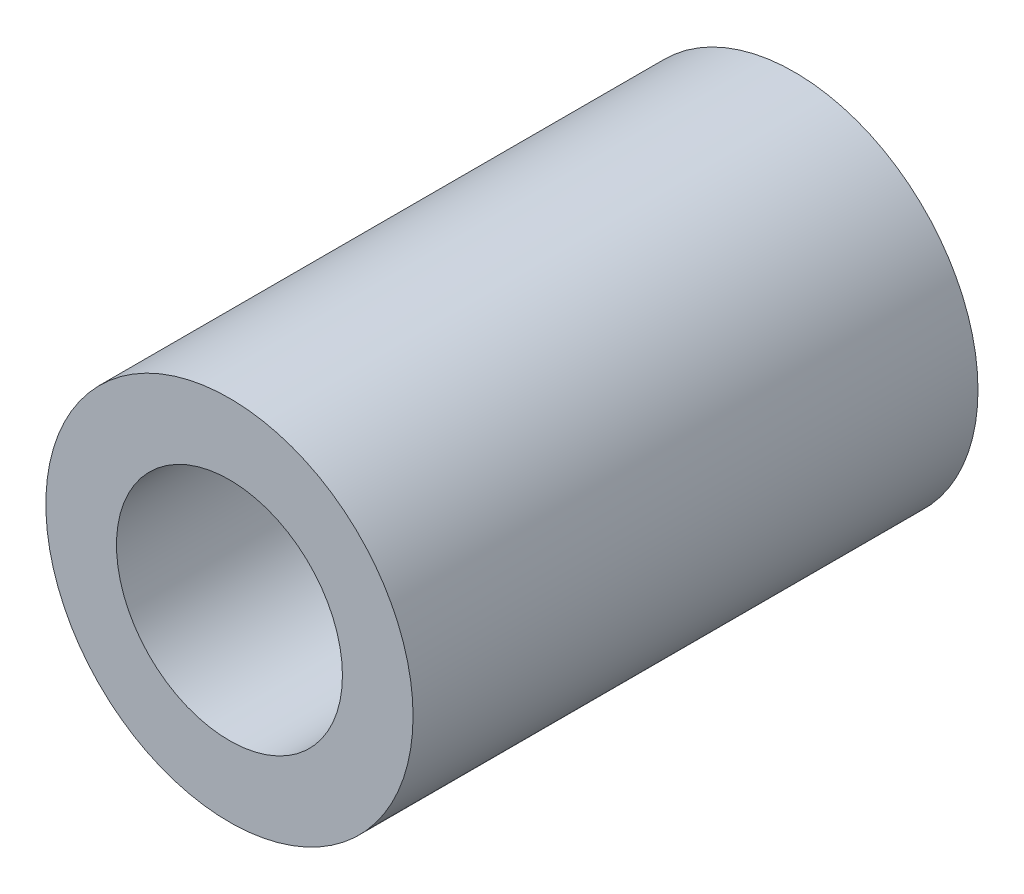
ISO-10303-21;
HEADER;
FILE_DESCRIPTION(('STEP AP214'),'2;1');
FILE_NAME('part.step','',(''),(''),'','','');
FILE_SCHEMA(('AUTOMOTIVE_DESIGN { 1 0 10303 214 1 1 1 1 }'));
ENDSEC;
DATA;
#1=APPLICATION_CONTEXT('core data for automotive mechanical design processes');
#2=APPLICATION_PROTOCOL_DEFINITION('international standard','automotive_design',2000,#1);
#3=PRODUCT_CONTEXT('',#1,'mechanical');
#4=PRODUCT('Part','Part','',(#3));
#5=PRODUCT_RELATED_PRODUCT_CATEGORY('part','',(#4));
#6=PRODUCT_DEFINITION_FORMATION('','',#4);
#7=PRODUCT_DEFINITION_CONTEXT('part definition',#1,'design');
#8=PRODUCT_DEFINITION('design','',#6,#7);
#9=PRODUCT_DEFINITION_SHAPE('','',#8);
#10=(LENGTH_UNIT() NAMED_UNIT(*) SI_UNIT(.MILLI.,.METRE.));
#11=(NAMED_UNIT(*) PLANE_ANGLE_UNIT() SI_UNIT($,.RADIAN.));
#12=(NAMED_UNIT(*) SI_UNIT($,.STERADIAN.) SOLID_ANGLE_UNIT());
#13=UNCERTAINTY_MEASURE_WITH_UNIT(LENGTH_MEASURE(1.E-05),#10,'distance_accuracy_value','');
#14=(GEOMETRIC_REPRESENTATION_CONTEXT(3) GLOBAL_UNCERTAINTY_ASSIGNED_CONTEXT((#13)) GLOBAL_UNIT_ASSIGNED_CONTEXT((#10,
#11,#12)) REPRESENTATION_CONTEXT('',''));
#15=CARTESIAN_POINT('',(0.,0.,0.));
#16=DIRECTION('',(0.,0.,1.));
#17=DIRECTION('',(1.,0.,0.));
#18=AXIS2_PLACEMENT_3D('',#15,#16,#17);
#19=CARTESIAN_POINT('',(0.,0.,10.));
#20=DIRECTION('',(0.,0.,1.));
#21=DIRECTION('',(1.,0.,0.));
#22=AXIS2_PLACEMENT_3D('',#19,#20,#21);
#23=PLANE('',#22);
#24=CARTESIAN_POINT('',(0.,0.,10.));
#25=DIRECTION('',(0.,0.,1.));
#26=DIRECTION('',(1.,0.,0.));
#27=AXIS2_PLACEMENT_3D('',#24,#25,#26);
#28=CIRCLE('',#27,3.25);
#29=CARTESIAN_POINT('',(3.25,0.,10.));
#30=VERTEX_POINT('',#29);
#31=EDGE_CURVE('E10',#30,#30,#28,.T.);
#32=ORIENTED_EDGE('',*,*,#31,.T.);
#33=EDGE_LOOP('',(#32));
#34=FACE_BOUND('',#33,.T.);
#35=CARTESIAN_POINT('',(0.,0.,10.));
#36=DIRECTION('',(0.,0.,1.));
#37=DIRECTION('',(1.,0.,0.));
#38=AXIS2_PLACEMENT_3D('',#35,#36,#37);
#39=CIRCLE('',#38,2.);
#40=CARTESIAN_POINT('',(2.,0.,10.));
#41=VERTEX_POINT('',#40);
#42=EDGE_CURVE('E50',#41,#41,#39,.T.);
#43=ORIENTED_EDGE('',*,*,#42,.F.);
#44=EDGE_LOOP('',(#43));
#45=FACE_BOUND('',#44,.T.);
#46=ADVANCED_FACE('F37',(#34,#45),#23,.T.);
#47=CARTESIAN_POINT('',(0.,0.,0.));
#48=DIRECTION('',(0.,0.,1.));
#49=DIRECTION('',(1.,0.,0.));
#50=AXIS2_PLACEMENT_3D('',#47,#48,#49);
#51=PLANE('',#50);
#52=CARTESIAN_POINT('',(0.,0.,0.));
#53=DIRECTION('',(0.,0.,1.));
#54=DIRECTION('',(1.,0.,0.));
#55=AXIS2_PLACEMENT_3D('',#52,#53,#54);
#56=CIRCLE('',#55,3.25);
#57=CARTESIAN_POINT('',(3.25,0.,0.));
#58=VERTEX_POINT('',#57);
#59=EDGE_CURVE('E41',#58,#58,#56,.T.);
#60=ORIENTED_EDGE('',*,*,#59,.F.);
#61=EDGE_LOOP('',(#60));
#62=FACE_BOUND('',#61,.T.);
#63=CARTESIAN_POINT('',(0.,0.,0.));
#64=DIRECTION('',(0.,0.,1.));
#65=DIRECTION('',(1.,0.,0.));
#66=AXIS2_PLACEMENT_3D('',#63,#64,#65);
#67=CIRCLE('',#66,2.);
#68=CARTESIAN_POINT('',(2.,0.,0.));
#69=VERTEX_POINT('',#68);
#70=EDGE_CURVE('E52',#69,#69,#67,.T.);
#71=ORIENTED_EDGE('',*,*,#70,.T.);
#72=EDGE_LOOP('',(#71));
#73=FACE_BOUND('',#72,.T.);
#74=ADVANCED_FACE('F64',(#62,#73),#51,.F.);
#75=CARTESIAN_POINT('',(0.,0.,10.));
#76=DIRECTION('',(0.,0.,-1.));
#77=DIRECTION('',(-1.,0.,0.));
#78=AXIS2_PLACEMENT_3D('',#75,#76,#77);
#79=CYLINDRICAL_SURFACE('',#78,3.25);
#80=ORIENTED_EDGE('',*,*,#31,.F.);
#81=EDGE_LOOP('',(#80));
#82=FACE_BOUND('',#81,.T.);
#83=ORIENTED_EDGE('',*,*,#59,.T.);
#84=EDGE_LOOP('',(#83));
#85=FACE_BOUND('',#84,.T.);
#86=ADVANCED_FACE('F39',(#82,#85),#79,.T.);
#87=CARTESIAN_POINT('',(0.,0.,10.));
#88=DIRECTION('',(0.,0.,-1.));
#89=DIRECTION('',(-1.,0.,0.));
#90=AXIS2_PLACEMENT_3D('',#87,#88,#89);
#91=CYLINDRICAL_SURFACE('',#90,2.);
#92=ORIENTED_EDGE('',*,*,#42,.T.);
#93=EDGE_LOOP('',(#92));
#94=FACE_BOUND('',#93,.T.);
#95=ORIENTED_EDGE('',*,*,#70,.F.);
#96=EDGE_LOOP('',(#95));
#97=FACE_BOUND('',#96,.T.);
#98=ADVANCED_FACE('F60',(#94,#97),#91,.F.);
#99=CLOSED_SHELL('',(#46,#74,#86,#98));
#100=MANIFOLD_SOLID_BREP('B2',#99);
#101=ADVANCED_BREP_SHAPE_REPRESENTATION('',(#18,#100),#14);
#102=SHAPE_DEFINITION_REPRESENTATION(#9,#101);
ENDSEC;
END-ISO-10303-21;
